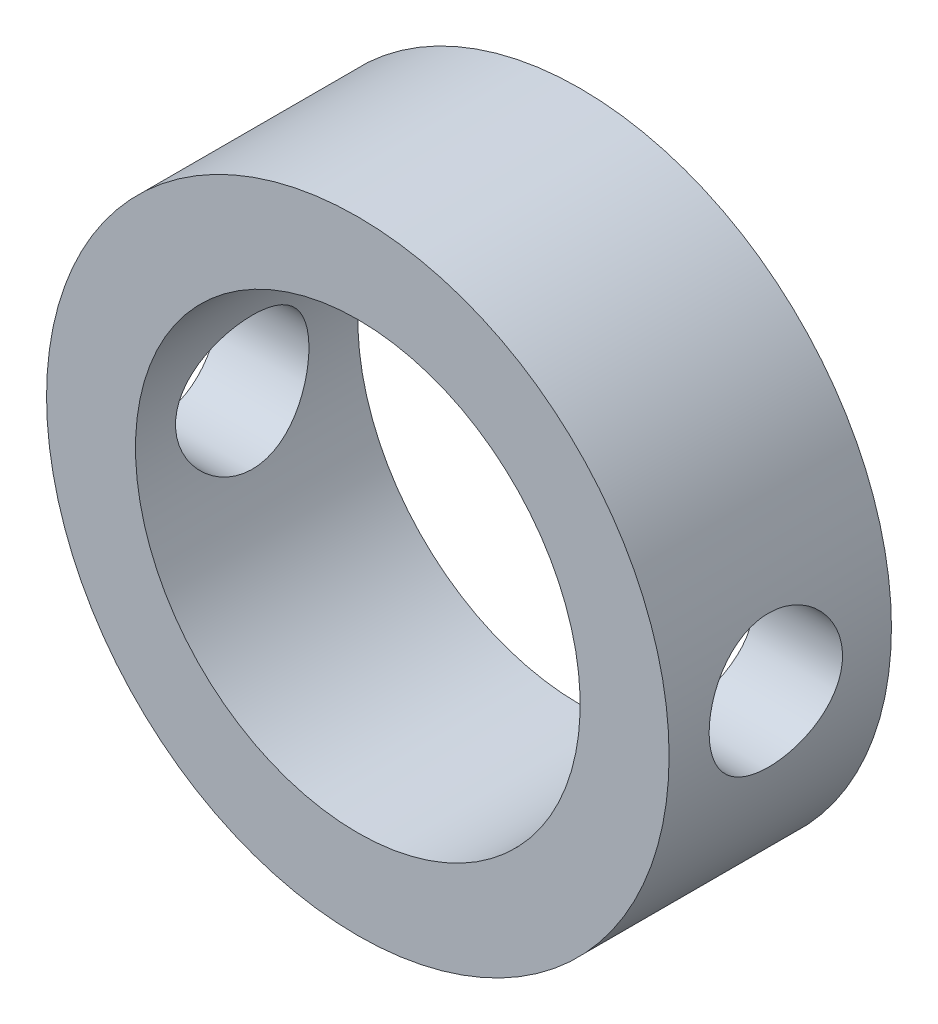
ISO-10303-21;
HEADER;
FILE_DESCRIPTION(('STEP AP214'),'2;1');
FILE_NAME('part.step','',(''),(''),'','','');
FILE_SCHEMA(('AUTOMOTIVE_DESIGN { 1 0 10303 214 1 1 1 1 }'));
ENDSEC;
DATA;
#1=APPLICATION_CONTEXT('core data for automotive mechanical design processes');
#2=APPLICATION_PROTOCOL_DEFINITION('international standard','automotive_design',2000,#1);
#3=PRODUCT_CONTEXT('',#1,'mechanical');
#4=PRODUCT('Part','Part','',(#3));
#5=PRODUCT_RELATED_PRODUCT_CATEGORY('part','',(#4));
#6=PRODUCT_DEFINITION_FORMATION('','',#4);
#7=PRODUCT_DEFINITION_CONTEXT('part definition',#1,'design');
#8=PRODUCT_DEFINITION('design','',#6,#7);
#9=PRODUCT_DEFINITION_SHAPE('','',#8);
#10=(LENGTH_UNIT() NAMED_UNIT(*) SI_UNIT(.MILLI.,.METRE.));
#11=(NAMED_UNIT(*) PLANE_ANGLE_UNIT() SI_UNIT($,.RADIAN.));
#12=(NAMED_UNIT(*) SI_UNIT($,.STERADIAN.) SOLID_ANGLE_UNIT());
#13=UNCERTAINTY_MEASURE_WITH_UNIT(LENGTH_MEASURE(1.E-05),#10,'distance_accuracy_value','');
#14=(GEOMETRIC_REPRESENTATION_CONTEXT(3) GLOBAL_UNCERTAINTY_ASSIGNED_CONTEXT((#13)) GLOBAL_UNIT_ASSIGNED_CONTEXT((#10,
#11,#12)) REPRESENTATION_CONTEXT('',''));
#15=CARTESIAN_POINT('',(0.,0.,0.));
#16=DIRECTION('',(0.,0.,1.));
#17=DIRECTION('',(1.,0.,0.));
#18=AXIS2_PLACEMENT_3D('',#15,#16,#17);
#19=CARTESIAN_POINT('',(0.,0.,2.5));
#20=DIRECTION('',(0.,0.,1.));
#21=DIRECTION('',(0.,-1.,0.));
#22=AXIS2_PLACEMENT_3D('',#19,#20,#21);
#23=PLANE('',#22);
#24=CARTESIAN_POINT('',(0.,0.,2.5));
#25=DIRECTION('',(0.,0.,1.));
#26=DIRECTION('',(0.,-1.,0.));
#27=AXIS2_PLACEMENT_3D('',#24,#25,#26);
#28=CIRCLE('',#27,3.5);
#29=CARTESIAN_POINT('',(0.,-3.5,2.5));
#30=VERTEX_POINT('',#29);
#31=EDGE_CURVE('E10',#30,#30,#28,.T.);
#32=ORIENTED_EDGE('',*,*,#31,.T.);
#33=EDGE_LOOP('',(#32));
#34=FACE_BOUND('',#33,.T.);
#35=CARTESIAN_POINT('',(0.,0.,2.5));
#36=DIRECTION('',(0.,0.,1.));
#37=DIRECTION('',(0.,-1.,0.));
#38=AXIS2_PLACEMENT_3D('',#35,#36,#37);
#39=CIRCLE('',#38,2.5);
#40=CARTESIAN_POINT('',(0.,-2.5,2.5));
#41=VERTEX_POINT('',#40);
#42=EDGE_CURVE('E22',#41,#41,#39,.T.);
#43=ORIENTED_EDGE('',*,*,#42,.F.);
#44=EDGE_LOOP('',(#43));
#45=FACE_BOUND('',#44,.T.);
#46=ADVANCED_FACE('F15',(#34,#45),#23,.T.);
#47=CARTESIAN_POINT('',(0.,0.,0.));
#48=DIRECTION('',(0.,0.,1.));
#49=DIRECTION('',(0.,-1.,0.));
#50=AXIS2_PLACEMENT_3D('',#47,#48,#49);
#51=PLANE('',#50);
#52=CARTESIAN_POINT('',(0.,0.,0.));
#53=DIRECTION('',(0.,0.,1.));
#54=DIRECTION('',(0.,-1.,0.));
#55=AXIS2_PLACEMENT_3D('',#52,#53,#54);
#56=CIRCLE('',#55,3.5);
#57=CARTESIAN_POINT('',(0.,-3.5,0.));
#58=VERTEX_POINT('',#57);
#59=EDGE_CURVE('E29',#58,#58,#56,.T.);
#60=ORIENTED_EDGE('',*,*,#59,.F.);
#61=EDGE_LOOP('',(#60));
#62=FACE_BOUND('',#61,.T.);
#63=CARTESIAN_POINT('',(0.,0.,0.));
#64=DIRECTION('',(0.,0.,1.));
#65=DIRECTION('',(0.,-1.,0.));
#66=AXIS2_PLACEMENT_3D('',#63,#64,#65);
#67=CIRCLE('',#66,2.5);
#68=CARTESIAN_POINT('',(0.,-2.5,0.));
#69=VERTEX_POINT('',#68);
#70=EDGE_CURVE('E35',#69,#69,#67,.T.);
#71=ORIENTED_EDGE('',*,*,#70,.T.);
#72=EDGE_LOOP('',(#71));
#73=FACE_BOUND('',#72,.T.);
#74=ADVANCED_FACE('F99',(#62,#73),#51,.F.);
#75=CARTESIAN_POINT('',(0.,0.,2.5));
#76=DIRECTION('',(0.,0.,-1.));
#77=DIRECTION('',(0.,1.,0.));
#78=AXIS2_PLACEMENT_3D('',#75,#76,#77);
#79=CYLINDRICAL_SURFACE('',#78,3.5);
#80=CARTESIAN_POINT('',(-3.5,0.,0.55));
#81=CARTESIAN_POINT('',(-3.49999923021613,0.0416179430453083,0.550001449787151));
#82=CARTESIAN_POINT('',(-3.49925012974855,0.0832535978001372,0.553475804193928));
#83=CARTESIAN_POINT('',(-3.49633414913864,0.165343672146663,0.567267828426796));
#84=CARTESIAN_POINT('',(-3.49416622818549,0.205797201785595,0.577590522097467));
#85=CARTESIAN_POINT('',(-3.48865415894413,0.284324661908868,0.604742182304018));
#86=CARTESIAN_POINT('',(-3.48531121483585,0.322400981723277,0.621564489690659));
#87=CARTESIAN_POINT('',(-3.47781053408985,0.395189088980393,0.661217043085632));
#88=CARTESIAN_POINT('',(-3.4736528251833,0.429900990873685,0.684047084624971));
#89=CARTESIAN_POINT('',(-3.46490684623155,0.495512395267615,0.735440149836754));
#90=CARTESIAN_POINT('',(-3.4603134157163,0.526352517097226,0.764078110949263));
#91=CARTESIAN_POINT('',(-3.45125034907072,0.582830211947175,0.826113157842598));
#92=CARTESIAN_POINT('',(-3.44678072365815,0.608467335754541,0.859510654125629));
#93=CARTESIAN_POINT('',(-3.43842058023612,0.654071021899043,0.930552876430217));
#94=CARTESIAN_POINT('',(-3.4345366817218,0.673974791675044,0.968238758878105));
#95=CARTESIAN_POINT('',(-3.42786162779269,0.707144118455738,1.04651722688342));
#96=CARTESIAN_POINT('',(-3.42507034735356,0.720410435008579,1.08710947924629));
#97=CARTESIAN_POINT('',(-3.42094904463156,0.739732872112272,1.16940554329404));
#98=CARTESIAN_POINT('',(-3.41959778448243,0.745893898741712,1.21108363783193));
#99=CARTESIAN_POINT('',(-3.41844569922553,0.751156976032885,1.2949021162535));
#100=CARTESIAN_POINT('',(-3.41864469145864,0.750259858323147,1.33704244508998));
#101=CARTESIAN_POINT('',(-3.42055138301916,0.741516631704307,1.4198123439669));
#102=CARTESIAN_POINT('',(-3.42223270841081,0.73379199324704,1.46045544455008));
#103=CARTESIAN_POINT('',(-3.42687296687894,0.711805271493383,1.53985512014467));
#104=CARTESIAN_POINT('',(-3.42983196904201,0.697542834682329,1.57861159301616));
#105=CARTESIAN_POINT('',(-3.43672040377862,0.662772755379955,1.65348143643667));
#106=CARTESIAN_POINT('',(-3.44065710491682,0.642218054864147,1.68957225635628));
#107=CARTESIAN_POINT('',(-3.44905286250644,0.595480036419964,1.75783758247898));
#108=CARTESIAN_POINT('',(-3.45351198740948,0.56929598051781,1.7900115743431));
#109=CARTESIAN_POINT('',(-3.46256359196939,0.511397713776602,1.8502296778367));
#110=CARTESIAN_POINT('',(-3.46715691986089,0.479580116982205,1.87817435329237));
#111=CARTESIAN_POINT('',(-3.4758750874853,0.411658653134548,1.92834686684483));
#112=CARTESIAN_POINT('',(-3.47999991937986,0.375554714387699,1.95057460930019));
#113=CARTESIAN_POINT('',(-3.48732889267001,0.299966731024979,1.98870533995346));
#114=CARTESIAN_POINT('',(-3.49053119321677,0.260476129431742,2.00459570628899));
#115=CARTESIAN_POINT('',(-3.49564054622667,0.179301573342854,2.02948782416054));
#116=CARTESIAN_POINT('',(-3.49754777930192,0.137617925566835,2.03849053628165));
#117=CARTESIAN_POINT('',(-3.49982653173904,0.0540938354183145,2.04920810707171));
#118=CARTESIAN_POINT('',(-3.50022668260533,0.0122715886358078,2.05105885644089));
#119=CARTESIAN_POINT('',(-3.49952624467985,-0.0710844868252017,2.04778771443742));
#120=CARTESIAN_POINT('',(-3.49842575337849,-0.112618334063627,2.04266627601853));
#121=CARTESIAN_POINT('',(-3.49486571522633,-0.193771268991402,2.02570887816915));
#122=CARTESIAN_POINT('',(-3.4924205252273,-0.233405856454238,2.01394381526373));
#123=CARTESIAN_POINT('',(-3.48644462210755,-0.310139225236708,1.98411152850259));
#124=CARTESIAN_POINT('',(-3.48291381911119,-0.34723779629387,1.96604378284418));
#125=CARTESIAN_POINT('',(-3.475087521952,-0.418410698982377,1.92383322846984));
#126=CARTESIAN_POINT('',(-3.47078215677137,-0.452436287555569,1.89961010254514));
#127=CARTESIAN_POINT('',(-3.46190516517424,-0.515988462761796,1.84588258755563));
#128=CARTESIAN_POINT('',(-3.45733350571049,-0.545514489345998,1.81637754205628));
#129=CARTESIAN_POINT('',(-3.44834086353162,-0.599763555289945,1.75230131490643));
#130=CARTESIAN_POINT('',(-3.44392396110642,-0.624392686275782,1.71764995038895));
#131=CARTESIAN_POINT('',(-3.4358332727984,-0.667482076930201,1.644622701761));
#132=CARTESIAN_POINT('',(-3.43215945524027,-0.685942599568528,1.60624697651126));
#133=CARTESIAN_POINT('',(-3.42600504903695,-0.716048706242739,1.5270638505027));
#134=CARTESIAN_POINT('',(-3.42351787291483,-0.727731993206375,1.48627132178467));
#135=CARTESIAN_POINT('',(-3.42000593354209,-0.744063480426676,1.40324220808318));
#136=CARTESIAN_POINT('',(-3.41898094719853,-0.748712753901288,1.36100584439934));
#137=CARTESIAN_POINT('',(-3.41852309424078,-0.750799999630203,1.27723382841238));
#138=CARTESIAN_POINT('',(-3.41905738259271,-0.748386736291556,1.23570199250971));
#139=CARTESIAN_POINT('',(-3.42158381592415,-0.736748947031653,1.15365137893371));
#140=CARTESIAN_POINT('',(-3.42357594513357,-0.727524494789894,1.11313259030672));
#141=CARTESIAN_POINT('',(-3.42877790552079,-0.702596729702168,1.03437067106542));
#142=CARTESIAN_POINT('',(-3.43198382112352,-0.686914235854434,0.996120675667857));
#143=CARTESIAN_POINT('',(-3.43925382295324,-0.649533757978004,0.922772313746576));
#144=CARTESIAN_POINT('',(-3.44331799440181,-0.627835176507499,0.887674260692478));
#145=CARTESIAN_POINT('',(-3.45194527796616,-0.578541451746518,0.820890903137317));
#146=CARTESIAN_POINT('',(-3.45651654969463,-0.550839937106183,0.789285152026511));
#147=CARTESIAN_POINT('',(-3.46558724899847,-0.49054327730981,0.731121868739771));
#148=CARTESIAN_POINT('',(-3.47008665975648,-0.457947004692798,0.704565502843898));
#149=CARTESIAN_POINT('',(-3.47857245524494,-0.388301573634358,0.656942020247219));
#150=CARTESIAN_POINT('',(-3.48255182285313,-0.351202423004821,0.63594669688451));
#151=CARTESIAN_POINT('',(-3.48947913052009,-0.273925080470299,0.600522735546909));
#152=CARTESIAN_POINT('',(-3.49242795106171,-0.23374955293194,0.586088488707483));
#153=CARTESIAN_POINT('',(-3.49642424230886,-0.161267608776602,0.566823907434426));
#154=CARTESIAN_POINT('',(-3.49775695944132,-0.12935860277299,0.560526783009985));
#155=CARTESIAN_POINT('',(-3.4995451207736,-0.0649699804269232,0.552114349144166));
#156=CARTESIAN_POINT('',(-3.50000060095657,-0.0324903875443725,0.54999886817697));
#157=CARTESIAN_POINT('',(-3.5,0.,0.55));
#158=B_SPLINE_CURVE_WITH_KNOTS('',3,(#80,#81,#82,#83,#84,#85,#86,#87,#88,#89,#90,#91,#92,#93,
#94,#95,#96,#97,#98,#99,#100,#101,#102,#103,#104,#105,#106,#107,#108,#109,#110,#111,#112,#113,
#114,#115,#116,#117,#118,#119,#120,#121,#122,#123,#124,#125,#126,#127,#128,#129,#130,#131,#132,
#133,#134,#135,#136,#137,#138,#139,#140,#141,#142,#143,#144,#145,#146,#147,#148,#149,#150,#151,
#152,#153,#154,#155,#156,#157),.UNSPECIFIED.,.T.,.F.,(4,2,2,2,2,2,2,2,2,2,2,2,2,2,2,2,2,2,2,2,2,
2,2,2,2,2,2,2,2,2,2,2,2,2,2,2,2,2,4),(0.,0.124734918256041,0.249561441609967,0.374260412212801,
0.498955139322943,0.62537480940866,0.751805389592532,0.879572146072553,1.00732427838745,
1.13316504062333,1.25899097584583,1.38262237726464,1.50626046452285,1.63084678082984,
1.75544943960445,1.88263505525145,2.00982279851175,2.13726260569903,2.26468463628172,
2.38967332852092,2.51465390115714,2.63832530294633,2.76200694599217,2.88739366933901,
3.01279598652242,3.14041031641767,3.26801920537903,3.39491120204237,3.52178383614592,
3.64600340270147,3.77022162554135,3.89404249853392,4.01787567225811,4.14411475077057,
4.27038295198557,4.39820955178611,4.52592667005135,4.62330899566147,4.72068732668668),.UNSPECIFIED.);
#159=CARTESIAN_POINT('',(-3.5,0.,0.55));
#160=VERTEX_POINT('',#159);
#161=EDGE_CURVE('E41',#160,#160,#158,.T.);
#162=ORIENTED_EDGE('',*,*,#161,.T.);
#163=EDGE_LOOP('',(#162));
#164=FACE_BOUND('',#163,.T.);
#165=CARTESIAN_POINT('',(3.41869858279434,0.75,1.3));
#166=CARTESIAN_POINT('',(3.41869942294351,0.749998541194088,1.25839442376637));
#167=CARTESIAN_POINT('',(3.41946636233665,0.746526181228761,1.21677111305177));
#168=CARTESIAN_POINT('',(3.42244589278789,0.732742796269729,1.13470666390028));
#169=CARTESIAN_POINT('',(3.42465955623037,0.722426698268708,1.09426642566613));
#170=CARTESIAN_POINT('',(3.43027057629631,0.695294318421272,1.01576712520541));
#171=CARTESIAN_POINT('',(3.43366666358336,0.678485004956109,0.977705560937258));
#172=CARTESIAN_POINT('',(3.44125835428899,0.638863088367166,0.904942363029703));
#173=CARTESIAN_POINT('',(3.44545393440007,0.616050660244003,0.870240631486004));
#174=CARTESIAN_POINT('',(3.45424789397074,0.564675712850978,0.80461851925839));
#175=CARTESIAN_POINT('',(3.45885124935541,0.53603429741988,0.773760561879872));
#176=CARTESIAN_POINT('',(3.46789845855534,0.473984754064823,0.717248222797255));
#177=CARTESIAN_POINT('',(3.47234230025799,0.440576265108847,0.691594235570006));
#178=CARTESIAN_POINT('',(3.48062384554625,0.369523644232282,0.645972277754244));
#179=CARTESIAN_POINT('',(3.4844549940969,0.331840244114974,0.62606417211468));
#180=CARTESIAN_POINT('',(3.49102335521491,0.2535671346713,0.592886154276865));
#181=CARTESIAN_POINT('',(3.4937606855167,0.212977738690156,0.579615527606863));
#182=CARTESIAN_POINT('',(3.49779782640583,0.130693593835755,0.560285014534327));
#183=CARTESIAN_POINT('',(3.49911866689191,0.0890247002984615,0.554119535723784));
#184=CARTESIAN_POINT('',(3.50024681103503,0.00522447265332272,0.548844361343372));
#185=CARTESIAN_POINT('',(3.50005428116349,-0.0369068100823793,0.549733889719622));
#186=CARTESIAN_POINT('',(3.49819350431278,-0.119708514625256,0.558464482331792));
#187=CARTESIAN_POINT('',(3.49654941576215,-0.160391557681056,0.566191750144961));
#188=CARTESIAN_POINT('',(3.49199770794553,-0.239869731989195,0.588197340925932));
#189=CARTESIAN_POINT('',(3.4890900330826,-0.278664780087527,0.60247595214987));
#190=CARTESIAN_POINT('',(3.48229877323429,-0.353583748778276,0.637280729444259));
#191=CARTESIAN_POINT('',(3.47840842901973,-0.389686828507894,0.657850383602173));
#192=CARTESIAN_POINT('',(3.47007896871932,-0.457970463281423,0.704620984081799));
#193=CARTESIAN_POINT('',(3.46563978072347,-0.490150503225764,0.730822668650151));
#194=CARTESIAN_POINT('',(3.45659663230463,-0.55035104400099,0.788734272263933));
#195=CARTESIAN_POINT('',(3.45199115186426,-0.578275586601252,0.820543789678518));
#196=CARTESIAN_POINT('',(3.44321783415987,-0.62841121617364,0.888441642534254));
#197=CARTESIAN_POINT('',(3.43905000781693,-0.650622160590342,0.924530084702624));
#198=CARTESIAN_POINT('',(3.43162011793361,-0.688740387866482,1.00011225053188));
#199=CARTESIAN_POINT('',(3.42836057563888,-0.704630175444614,1.03961506192622));
#200=CARTESIAN_POINT('',(3.42315170403308,-0.729517475795577,1.12081638297322));
#201=CARTESIAN_POINT('',(3.42120217609242,-0.738516033473139,1.1625145587216));
#202=CARTESIAN_POINT('',(3.41887440627723,-0.74921793012326,1.24604787632486));
#203=CARTESIAN_POINT('',(3.41846613525851,-0.7510607096432,1.28786433753865));
#204=CARTESIAN_POINT('',(3.41918619786997,-0.747775698211867,1.37120699659085));
#205=CARTESIAN_POINT('',(3.42031443050531,-0.742648365408176,1.41273321332678));
#206=CARTESIAN_POINT('',(3.42395207742103,-0.725689473177921,1.49383521749038));
#207=CARTESIAN_POINT('',(3.42644577637182,-0.713934151257766,1.53342771629848));
#208=CARTESIAN_POINT('',(3.43251929934889,-0.684135264733746,1.61008116876646));
#209=CARTESIAN_POINT('',(3.43609922386425,-0.666091118314091,1.6471418878171));
#210=CARTESIAN_POINT('',(3.44400817040173,-0.623917522083524,1.71828484237946));
#211=CARTESIAN_POINT('',(3.44834750873158,-0.59970184295396,1.75231479100609));
#212=CARTESIAN_POINT('',(3.4572588768007,-0.545985919168002,1.8158791729369));
#213=CARTESIAN_POINT('',(3.46183093417231,-0.516485045910805,1.84541307072423));
#214=CARTESIAN_POINT('',(3.47079119995087,-0.452406382210408,1.89968515147238));
#215=CARTESIAN_POINT('',(3.47517467803873,-0.417747462914386,1.92432845807851));
#216=CARTESIAN_POINT('',(3.4831780535745,-0.344700740641138,1.96744270467552));
#217=CARTESIAN_POINT('',(3.48679798588346,-0.30631310802187,1.98591392648642));
#218=CARTESIAN_POINT('',(3.49284639190787,-0.22713270949102,2.01602602731924));
#219=CARTESIAN_POINT('',(3.49528221901849,-0.186356596537586,2.02770915187314));
#220=CARTESIAN_POINT('',(3.4987196965099,-0.103362588501644,2.04404585286616));
#221=CARTESIAN_POINT('',(3.49972154656148,-0.0611448949869966,2.04870040798696));
#222=CARTESIAN_POINT('',(3.50017255504529,0.022631858526414,2.05080532620593));
#223=CARTESIAN_POINT('',(3.49965229500834,0.0641872527546141,2.04839757930231));
#224=CARTESIAN_POINT('',(3.49718276181691,0.14628646920798,2.03676261824048));
#225=CARTESIAN_POINT('',(3.49523351236843,0.186830308202641,2.02753551721084));
#226=CARTESIAN_POINT('',(3.49012694319269,0.265650974243634,2.00259059687525));
#227=CARTESIAN_POINT('',(3.48697323215248,0.303934182536588,1.98689215530722));
#228=CARTESIAN_POINT('',(3.47979518025329,0.37734247836161,1.94946936441544));
#229=CARTESIAN_POINT('',(3.47577075860164,0.41246727239807,1.92774445584699));
#230=CARTESIAN_POINT('',(3.46719904967253,0.479256153447622,1.87841884062867));
#231=CARTESIAN_POINT('',(3.4626435445396,0.510845182552889,1.85071792083935));
#232=CARTESIAN_POINT('',(3.45356845037895,0.568975007288211,1.79042969487482));
#233=CARTESIAN_POINT('',(3.44904887022754,0.595514590312101,1.75784121832217));
#234=CARTESIAN_POINT('',(3.44049346826047,0.643116307983381,1.68820475340718));
#235=CARTESIAN_POINT('',(3.43646452978599,0.664104489048105,1.65110532085657));
#236=CARTESIAN_POINT('',(3.42943248613692,0.699515023299102,1.57382813953829));
#237=CARTESIAN_POINT('',(3.42642849789546,0.713943032119568,1.53365307737316));
#238=CARTESIAN_POINT('',(3.42235280321944,0.733193035607852,1.4611869344073));
#239=CARTESIAN_POINT('',(3.42099141547115,0.739483762538932,1.42929416214686));
#240=CARTESIAN_POINT('',(3.41916399749064,0.74788772021697,1.36493784421057));
#241=CARTESIAN_POINT('',(3.41869792703424,0.750001138639108,1.33247432424298));
#242=CARTESIAN_POINT('',(3.41869858279434,0.75,1.3));
#243=B_SPLINE_CURVE_WITH_KNOTS('',3,(#165,#166,#167,#168,#169,#170,#171,#172,#173,#174,#175,
#176,#177,#178,#179,#180,#181,#182,#183,#184,#185,#186,#187,#188,#189,#190,#191,#192,#193,#194,
#195,#196,#197,#198,#199,#200,#201,#202,#203,#204,#205,#206,#207,#208,#209,#210,#211,#212,#213,
#214,#215,#216,#217,#218,#219,#220,#221,#222,#223,#224,#225,#226,#227,#228,#229,#230,#231,#232,
#233,#234,#235,#236,#237,#238,#239,#240,#241,#242),.UNSPECIFIED.,.T.,.F.,(4,2,2,2,2,2,2,2,2,2,2,
2,2,2,2,2,2,2,2,2,2,2,2,2,2,2,2,2,2,2,2,2,2,2,2,2,2,2,4),(0.,0.124697741002728,
0.249488019218578,0.374144745554975,0.498797838346236,0.625266147892055,0.751744040542987,
0.879495674079986,1.00723355320993,1.13304754073824,1.2588476888648,1.38259278831545,
1.50634333301651,1.63096944069578,1.75561189434017,1.88274480387507,2.00988088509405,
2.1373664370375,2.26483265474779,2.38980216594121,2.51476346324818,2.63831590372547,
2.76187977779434,2.88727505106018,3.01268524827398,3.14033107339464,3.2679710693563,
3.39480794910047,3.52162716602129,3.64591599819923,3.77020276855409,3.89412004807601,
4.01804883073542,4.14424457078342,4.27047057813476,4.39830190081484,4.52602280803703,
4.62335728058995,4.72068738006871),.UNSPECIFIED.);
#244=CARTESIAN_POINT('',(3.41869858279434,0.75,1.3));
#245=VERTEX_POINT('',#244);
#246=EDGE_CURVE('E51',#245,#245,#243,.T.);
#247=ORIENTED_EDGE('',*,*,#246,.T.);
#248=EDGE_LOOP('',(#247));
#249=FACE_BOUND('',#248,.T.);
#250=ORIENTED_EDGE('',*,*,#31,.F.);
#251=EDGE_LOOP('',(#250));
#252=FACE_BOUND('',#251,.T.);
#253=ORIENTED_EDGE('',*,*,#59,.T.);
#254=EDGE_LOOP('',(#253));
#255=FACE_BOUND('',#254,.T.);
#256=ADVANCED_FACE('F57',(#164,#249,#252,#255),#79,.T.);
#257=CARTESIAN_POINT('',(0.,0.,2.5));
#258=DIRECTION('',(0.,0.,-1.));
#259=DIRECTION('',(0.,1.,0.));
#260=AXIS2_PLACEMENT_3D('',#257,#258,#259);
#261=CYLINDRICAL_SURFACE('',#260,2.5);
#262=CARTESIAN_POINT('',(-2.38484800354236,0.75,1.3));
#263=CARTESIAN_POINT('',(-2.38484842882331,0.74999948817099,1.34109727395872));
#264=CARTESIAN_POINT('',(-2.38592195177072,0.746610540845051,1.38219961203494));
#265=CARTESIAN_POINT('',(-2.39008289224361,0.733179222242705,1.46320262476173));
#266=CARTESIAN_POINT('',(-2.39317098266287,0.72313462786923,1.50310289324392));
#267=CARTESIAN_POINT('',(-2.40098051223348,0.696763766346654,1.58051736414791));
#268=CARTESIAN_POINT('',(-2.40569923346394,0.680447946970379,1.61803541481977));
#269=CARTESIAN_POINT('',(-2.41623466279006,0.642032109590483,1.68981096699442));
#270=CARTESIAN_POINT('',(-2.42205153521927,0.619931225685491,1.72406797934135));
#271=CARTESIAN_POINT('',(-2.43433431091424,0.5698237707079,1.78943319528959));
#272=CARTESIAN_POINT('',(-2.44081404155427,0.541666035878968,1.82042294897339));
#273=CARTESIAN_POINT('',(-2.4535743096877,0.48056811878986,1.87731897566101));
#274=CARTESIAN_POINT('',(-2.45985482148958,0.447627322730572,1.90322459522488));
#275=CARTESIAN_POINT('',(-2.47166607289586,0.377055718896827,1.94973134991672));
#276=CARTESIAN_POINT('',(-2.47717862171173,0.339342010667901,1.97021171222142));
#277=CARTESIAN_POINT('',(-2.48667217960371,0.26081232268468,2.00449362952136));
#278=CARTESIAN_POINT('',(-2.49065351894755,0.219997014193956,2.01829662492872));
#279=CARTESIAN_POINT('',(-2.49653823001787,0.137661926315414,2.03844000054526));
#280=CARTESIAN_POINT('',(-2.49849778684667,0.0961956994769001,2.04498256382635));
#281=CARTESIAN_POINT('',(-2.50031600750676,0.0127109118746577,2.05105866232322));
#282=CARTESIAN_POINT('',(-2.50017511260539,-0.0293075310251842,2.05059366970098));
#283=CARTESIAN_POINT('',(-2.49784801908829,-0.111285578300081,2.04280356572848));
#284=CARTESIAN_POINT('',(-2.49572710102631,-0.151268133820671,2.03569740309506));
#285=CARTESIAN_POINT('',(-2.48975761056295,-0.229444606721264,2.01518433200286));
#286=CARTESIAN_POINT('',(-2.48590892875287,-0.267638410661424,2.00177702452867));
#287=CARTESIAN_POINT('',(-2.47682610493488,-0.341673663175641,1.96889398829072));
#288=CARTESIAN_POINT('',(-2.47157634838376,-0.377482532347239,1.94934939859637));
#289=CARTESIAN_POINT('',(-2.46024820324011,-0.445382336891577,1.90480107378589));
#290=CARTESIAN_POINT('',(-2.45416961818801,-0.477472387436064,1.87979604351827));
#291=CARTESIAN_POINT('',(-2.44155775244174,-0.538330240764901,1.82390112462419));
#292=CARTESIAN_POINT('',(-2.43501597661077,-0.566922290200561,1.7928215404851));
#293=CARTESIAN_POINT('',(-2.42241989943402,-0.618538257699113,1.72624499105501));
#294=CARTESIAN_POINT('',(-2.41636564657215,-0.641561622414246,1.69074758730551));
#295=CARTESIAN_POINT('',(-2.40538951600145,-0.681569976677269,1.61588026537538));
#296=CARTESIAN_POINT('',(-2.40047905352876,-0.698494946188462,1.57647647706807));
#297=CARTESIAN_POINT('',(-2.39248196269322,-0.725416814392002,1.4951963957777));
#298=CARTESIAN_POINT('',(-2.38939473939638,-0.735415973202559,1.45332091423448));
#299=CARTESIAN_POINT('',(-2.38552424788241,-0.747873851410238,1.36995881963415));
#300=CARTESIAN_POINT('',(-2.38465939399775,-0.75059973190118,1.3285158880579));
#301=CARTESIAN_POINT('',(-2.38510596285214,-0.749179736165385,1.24576354999708));
#302=CARTESIAN_POINT('',(-2.38641708095323,-0.745034821855962,1.2044541256326));
#303=CARTESIAN_POINT('',(-2.390987792609,-0.730228817870646,1.1242558110112));
#304=CARTESIAN_POINT('',(-2.39419588249304,-0.719739807156319,1.08533191786734));
#305=CARTESIAN_POINT('',(-2.40214570620055,-0.69274288873978,1.00979915459344));
#306=CARTESIAN_POINT('',(-2.40688767680741,-0.676234051713819,0.973190642929959));
#307=CARTESIAN_POINT('',(-2.41752917510286,-0.637159355982479,0.902241267963683));
#308=CARTESIAN_POINT('',(-2.42345635534567,-0.614442820863638,0.867987639507037));
#309=CARTESIAN_POINT('',(-2.43574102823826,-0.563776508001929,0.803680946909665));
#310=CARTESIAN_POINT('',(-2.44209862365092,-0.535825477674485,0.773628891193623));
#311=CARTESIAN_POINT('',(-2.45481816773985,-0.474227566246798,0.717409797092613));
#312=CARTESIAN_POINT('',(-2.46117122531477,-0.440405532928717,0.691432185506504));
#313=CARTESIAN_POINT('',(-2.4729242587435,-0.368730892295125,0.645516649486129));
#314=CARTESIAN_POINT('',(-2.47832428192365,-0.330878485271972,0.62557842510927));
#315=CARTESIAN_POINT('',(-2.48752985237472,-0.25246775235261,0.592499984715851));
#316=CARTESIAN_POINT('',(-2.49134726712481,-0.211932311018919,0.579308991920512));
#317=CARTESIAN_POINT('',(-2.49700989798415,-0.129084983252293,0.55996954055479));
#318=CARTESIAN_POINT('',(-2.4988556783544,-0.0867736086773809,0.553819067025791));
#319=CARTESIAN_POINT('',(-2.50033272040699,-0.00332607694137106,0.54888847797275));
#320=CARTESIAN_POINT('',(-2.50004652555661,0.0377925895431036,0.549833652296083));
#321=CARTESIAN_POINT('',(-2.49748632232518,0.119259740582202,0.558410816249561));
#322=CARTESIAN_POINT('',(-2.49521242665231,0.159608268673265,0.566042426740221));
#323=CARTESIAN_POINT('',(-2.48895584179164,0.237967906520679,0.587605830699812));
#324=CARTESIAN_POINT('',(-2.48499176450435,0.275999463675696,0.601469090324506));
#325=CARTESIAN_POINT('',(-2.47576471519723,0.349216618876026,0.635040957253596));
#326=CARTESIAN_POINT('',(-2.47050152974966,0.384401748025289,0.654750525143097));
#327=CARTESIAN_POINT('',(-2.45901982914122,0.452150946210283,0.700186728715015));
#328=CARTESIAN_POINT('',(-2.45277613461807,0.484595125038387,0.726085715000374));
#329=CARTESIAN_POINT('',(-2.44011768606139,0.544768785672969,0.782855194166409));
#330=CARTESIAN_POINT('',(-2.43370288320437,0.572496904800956,0.813727118949112));
#331=CARTESIAN_POINT('',(-2.42120340315766,0.623281346972756,0.880670389155217));
#332=CARTESIAN_POINT('',(-2.41513426347144,0.646173798789828,0.91686927669508));
#333=CARTESIAN_POINT('',(-2.40426273753995,0.685521567643832,0.99277758708065));
#334=CARTESIAN_POINT('',(-2.3994597429698,0.70197997778627,1.03248531180112));
#335=CARTESIAN_POINT('',(-2.39213908360134,0.726509712664902,1.10987021580267));
#336=CARTESIAN_POINT('',(-2.38943077425,0.735294295056704,1.14730432346385));
#337=CARTESIAN_POINT('',(-2.38578521293845,0.747039094175175,1.22315761124953));
#338=CARTESIAN_POINT('',(-2.38484760593099,0.750000478528448,1.26157659232873));
#339=CARTESIAN_POINT('',(-2.38484800354236,0.75,1.3));
#340=B_SPLINE_CURVE_WITH_KNOTS('',3,(#262,#263,#264,#265,#266,#267,#268,#269,#270,#271,#272,
#273,#274,#275,#276,#277,#278,#279,#280,#281,#282,#283,#284,#285,#286,#287,#288,#289,#290,#291,
#292,#293,#294,#295,#296,#297,#298,#299,#300,#301,#302,#303,#304,#305,#306,#307,#308,#309,#310,
#311,#312,#313,#314,#315,#316,#317,#318,#319,#320,#321,#322,#323,#324,#325,#326,#327,#328,#329,
#330,#331,#332,#333,#334,#335,#336,#337,#338,#339),.UNSPECIFIED.,.T.,.F.,(4,2,2,2,2,2,2,2,2,2,2,
2,2,2,2,2,2,2,2,2,2,2,2,2,2,2,2,2,2,2,2,2,2,2,2,2,2,2,4),(0.,0.123150082939933,
0.246341320809976,0.369328207198575,0.492333512650531,0.618865750005399,0.745414239321845,
0.874579696333703,1.00371727790486,1.12916070071327,1.25457777047268,1.37600062991988,
1.49743117941736,1.62027604664386,1.74315008291963,1.87076073508187,1.99838406242479,
2.12723119119681,2.25603625310754,2.38004040390038,2.50402719546924,2.62479297462638,
2.74557740516123,2.86960365897924,2.99365962957691,3.12239753043531,3.25112903655331,
3.37887695900392,3.50658831154071,3.6293815194884,3.75216776517107,3.87363548429339,
3.99512317238919,4.12049813520474,4.24590926308175,4.37505819827803,4.50414496975202,
4.61930576921953,4.7344434751001),.UNSPECIFIED.);
#341=CARTESIAN_POINT('',(-2.38484800354236,0.75,1.3));
#342=VERTEX_POINT('',#341);
#343=EDGE_CURVE('E73',#342,#342,#340,.T.);
#344=ORIENTED_EDGE('',*,*,#343,.F.);
#345=EDGE_LOOP('',(#344));
#346=FACE_BOUND('',#345,.T.);
#347=CARTESIAN_POINT('',(2.38484800354236,0.75,1.3));
#348=CARTESIAN_POINT('',(2.38484842882331,0.74999948817099,1.25890272604128));
#349=CARTESIAN_POINT('',(2.38592195177072,0.746610540845051,1.21780038796506));
#350=CARTESIAN_POINT('',(2.39008289224361,0.733179222242705,1.13679737523827));
#351=CARTESIAN_POINT('',(2.39317098266287,0.72313462786923,1.09689710675608));
#352=CARTESIAN_POINT('',(2.40098051223348,0.696763766346654,1.0194826358521));
#353=CARTESIAN_POINT('',(2.40569923346394,0.68044794697038,0.981964585180228));
#354=CARTESIAN_POINT('',(2.41623466279006,0.642032109590483,0.91018903300558));
#355=CARTESIAN_POINT('',(2.42205153521927,0.619931225685491,0.875932020658657));
#356=CARTESIAN_POINT('',(2.43433431091424,0.569823770707901,0.81056680471041));
#357=CARTESIAN_POINT('',(2.44081404155427,0.541666035878971,0.779577051026614));
#358=CARTESIAN_POINT('',(2.4535743096877,0.480568118789862,0.722681024338988));
#359=CARTESIAN_POINT('',(2.45985482148958,0.447627322730572,0.696775404775126));
#360=CARTESIAN_POINT('',(2.47166607289586,0.377055718896827,0.65026865008328));
#361=CARTESIAN_POINT('',(2.47717862171173,0.339342010667902,0.629788287778578));
#362=CARTESIAN_POINT('',(2.48667217960371,0.260812322684682,0.59550637047864));
#363=CARTESIAN_POINT('',(2.49065351894755,0.219997014193957,0.58170337507128));
#364=CARTESIAN_POINT('',(2.49653823001787,0.137661926315413,0.561559999454742));
#365=CARTESIAN_POINT('',(2.49849778684667,0.0961956994768999,0.555017436173648));
#366=CARTESIAN_POINT('',(2.50031600750676,0.0127109118746576,0.548941337676781));
#367=CARTESIAN_POINT('',(2.50017511260539,-0.0293075310251844,0.549406330299019));
#368=CARTESIAN_POINT('',(2.49784801908829,-0.111285578300081,0.557196434271511));
#369=CARTESIAN_POINT('',(2.49572710102631,-0.151268133820671,0.564302596904935));
#370=CARTESIAN_POINT('',(2.48975761056295,-0.229444606721264,0.584815667997145));
#371=CARTESIAN_POINT('',(2.48590892875287,-0.267638410661424,0.598222975471335));
#372=CARTESIAN_POINT('',(2.47682610493488,-0.341673663175641,0.631106011709279));
#373=CARTESIAN_POINT('',(2.47157634838376,-0.377482532347239,0.650650601403636));
#374=CARTESIAN_POINT('',(2.46024820324011,-0.445382336891578,0.695198926214112));
#375=CARTESIAN_POINT('',(2.45416961818801,-0.477472387436064,0.720203956481734));
#376=CARTESIAN_POINT('',(2.44155775244174,-0.538330240764901,0.776098875375808));
#377=CARTESIAN_POINT('',(2.43501597661077,-0.566922290200562,0.807178459514903));
#378=CARTESIAN_POINT('',(2.42241989943402,-0.618538257699114,0.873755008944993));
#379=CARTESIAN_POINT('',(2.41636564657215,-0.641561622414246,0.909252412694491));
#380=CARTESIAN_POINT('',(2.40538951600145,-0.681569976677269,0.984119734624622));
#381=CARTESIAN_POINT('',(2.40047905352876,-0.698494946188463,1.02352352293194));
#382=CARTESIAN_POINT('',(2.39248196269322,-0.725416814392003,1.1048036042223));
#383=CARTESIAN_POINT('',(2.38939473939638,-0.73541597320256,1.14667908576552));
#384=CARTESIAN_POINT('',(2.38552424788241,-0.747873851410238,1.23004118036585));
#385=CARTESIAN_POINT('',(2.38465939399775,-0.75059973190118,1.2714841119421));
#386=CARTESIAN_POINT('',(2.38510596285214,-0.749179736165385,1.35423645000292));
#387=CARTESIAN_POINT('',(2.38641708095323,-0.745034821855962,1.3955458743674));
#388=CARTESIAN_POINT('',(2.390987792609,-0.730228817870647,1.4757441889888));
#389=CARTESIAN_POINT('',(2.39419588249304,-0.71973980715632,1.51466808213266));
#390=CARTESIAN_POINT('',(2.40214570620055,-0.692742888739781,1.59020084540656));
#391=CARTESIAN_POINT('',(2.40688767680741,-0.676234051713818,1.62680935707004));
#392=CARTESIAN_POINT('',(2.41752917510286,-0.637159355982479,1.69775873203631));
#393=CARTESIAN_POINT('',(2.42345635534567,-0.61444282086364,1.73201236049296));
#394=CARTESIAN_POINT('',(2.43574102823825,-0.563776508001931,1.79631905309033));
#395=CARTESIAN_POINT('',(2.44209862365092,-0.535825477674484,1.82637110880637));
#396=CARTESIAN_POINT('',(2.45481816773985,-0.474227566246797,1.88259020290738));
#397=CARTESIAN_POINT('',(2.46117122531477,-0.440405532928718,1.9085678144935));
#398=CARTESIAN_POINT('',(2.4729242587435,-0.368730892295126,1.95448335051387));
#399=CARTESIAN_POINT('',(2.47832428192365,-0.330878485271972,1.97442157489073));
#400=CARTESIAN_POINT('',(2.48752985237472,-0.252467752352609,2.00750001528415));
#401=CARTESIAN_POINT('',(2.49134726712481,-0.211932311018918,2.02069100807949));
#402=CARTESIAN_POINT('',(2.49700989798415,-0.129084983252294,2.04003045944521));
#403=CARTESIAN_POINT('',(2.4988556783544,-0.0867736086773807,2.04618093297421));
#404=CARTESIAN_POINT('',(2.50033272040699,-0.00332607694137107,2.05111152202725));
#405=CARTESIAN_POINT('',(2.50004652555661,0.0377925895431033,2.05016634770392));
#406=CARTESIAN_POINT('',(2.49748632232518,0.119259740582202,2.04158918375044));
#407=CARTESIAN_POINT('',(2.49521242665231,0.159608268673265,2.03395757325978));
#408=CARTESIAN_POINT('',(2.48895584179164,0.237967906520679,2.01239416930019));
#409=CARTESIAN_POINT('',(2.48499176450435,0.275999463675695,1.99853090967549));
#410=CARTESIAN_POINT('',(2.47576471519723,0.349216618876025,1.9649590427464));
#411=CARTESIAN_POINT('',(2.47050152974966,0.384401748025289,1.94524947485691));
#412=CARTESIAN_POINT('',(2.45901982914122,0.452150946210283,1.89981327128499));
#413=CARTESIAN_POINT('',(2.45277613461807,0.484595125038386,1.87391428499963));
#414=CARTESIAN_POINT('',(2.44011768606139,0.544768785672968,1.81714480583359));
#415=CARTESIAN_POINT('',(2.43370288320437,0.572496904800955,1.78627288105089));
#416=CARTESIAN_POINT('',(2.42120340315766,0.623281346972756,1.71932961084478));
#417=CARTESIAN_POINT('',(2.41513426347144,0.646173798789828,1.68313072330492));
#418=CARTESIAN_POINT('',(2.40426273753995,0.685521567643832,1.60722241291935));
#419=CARTESIAN_POINT('',(2.3994597429698,0.70197997778627,1.56751468819888));
#420=CARTESIAN_POINT('',(2.39213908360134,0.726509712664902,1.49012978419733));
#421=CARTESIAN_POINT('',(2.38943077425,0.735294295056704,1.45269567653615));
#422=CARTESIAN_POINT('',(2.38578521293845,0.747039094175174,1.37684238875047));
#423=CARTESIAN_POINT('',(2.38484760593099,0.750000478528447,1.33842340767127));
#424=CARTESIAN_POINT('',(2.38484800354236,0.75,1.3));
#425=B_SPLINE_CURVE_WITH_KNOTS('',3,(#347,#348,#349,#350,#351,#352,#353,#354,#355,#356,#357,
#358,#359,#360,#361,#362,#363,#364,#365,#366,#367,#368,#369,#370,#371,#372,#373,#374,#375,#376,
#377,#378,#379,#380,#381,#382,#383,#384,#385,#386,#387,#388,#389,#390,#391,#392,#393,#394,#395,
#396,#397,#398,#399,#400,#401,#402,#403,#404,#405,#406,#407,#408,#409,#410,#411,#412,#413,#414,
#415,#416,#417,#418,#419,#420,#421,#422,#423,#424),.UNSPECIFIED.,.T.,.F.,(4,2,2,2,2,2,2,2,2,2,2,
2,2,2,2,2,2,2,2,2,2,2,2,2,2,2,2,2,2,2,2,2,2,2,2,2,2,2,4),(0.,0.123150082939933,
0.246341320809976,0.369328207198574,0.492333512650529,0.618865750005397,0.745414239321841,
0.8745796963337,1.00371727790486,1.12916070071327,1.25457777047268,1.37600062991988,
1.49743117941736,1.62027604664386,1.74315008291963,1.87076073508187,1.99838406242479,
2.12723119119681,2.25603625310754,2.38004040390038,2.50402719546923,2.62479297462638,
2.74557740516123,2.86960365897923,2.9936596295769,3.1223975304353,3.2511290365533,
3.37887695900392,3.5065883115407,3.62938151948839,3.75216776517107,3.87363548429339,
3.99512317238918,4.12049813520473,4.24590926308174,4.37505819827803,4.50414496975202,
4.61930576921953,4.73444347510009),.UNSPECIFIED.);
#426=CARTESIAN_POINT('',(2.38484800354236,0.75,1.3));
#427=VERTEX_POINT('',#426);
#428=EDGE_CURVE('E68',#427,#427,#425,.T.);
#429=ORIENTED_EDGE('',*,*,#428,.F.);
#430=EDGE_LOOP('',(#429));
#431=FACE_BOUND('',#430,.T.);
#432=ORIENTED_EDGE('',*,*,#42,.T.);
#433=EDGE_LOOP('',(#432));
#434=FACE_BOUND('',#433,.T.);
#435=ORIENTED_EDGE('',*,*,#70,.F.);
#436=EDGE_LOOP('',(#435));
#437=FACE_BOUND('',#436,.T.);
#438=ADVANCED_FACE('F61',(#346,#431,#434,#437),#261,.F.);
#439=CARTESIAN_POINT('',(-3.5,0.,1.3));
#440=DIRECTION('',(1.,0.,0.));
#441=DIRECTION('',(0.,1.,0.));
#442=AXIS2_PLACEMENT_3D('',#439,#440,#441);
#443=CYLINDRICAL_SURFACE('',#442,0.75);
#444=ORIENTED_EDGE('',*,*,#428,.T.);
#445=EDGE_LOOP('',(#444));
#446=FACE_BOUND('',#445,.T.);
#447=ORIENTED_EDGE('',*,*,#246,.F.);
#448=EDGE_LOOP('',(#447));
#449=FACE_BOUND('',#448,.T.);
#450=ADVANCED_FACE('F91',(#446,#449),#443,.F.);
#451=CARTESIAN_POINT('',(-3.5,0.,1.3));
#452=DIRECTION('',(1.,0.,0.));
#453=DIRECTION('',(0.,1.,0.));
#454=AXIS2_PLACEMENT_3D('',#451,#452,#453);
#455=CYLINDRICAL_SURFACE('',#454,0.75);
#456=ORIENTED_EDGE('',*,*,#343,.T.);
#457=EDGE_LOOP('',(#456));
#458=FACE_BOUND('',#457,.T.);
#459=ORIENTED_EDGE('',*,*,#161,.F.);
#460=EDGE_LOOP('',(#459));
#461=FACE_BOUND('',#460,.T.);
#462=ADVANCED_FACE('F146',(#458,#461),#455,.F.);
#463=CLOSED_SHELL('',(#46,#74,#256,#438,#450,#462));
#464=MANIFOLD_SOLID_BREP('B1',#463);
#465=ADVANCED_BREP_SHAPE_REPRESENTATION('',(#18,#464),#14);
#466=SHAPE_DEFINITION_REPRESENTATION(#9,#465);
ENDSEC;
END-ISO-10303-21;
